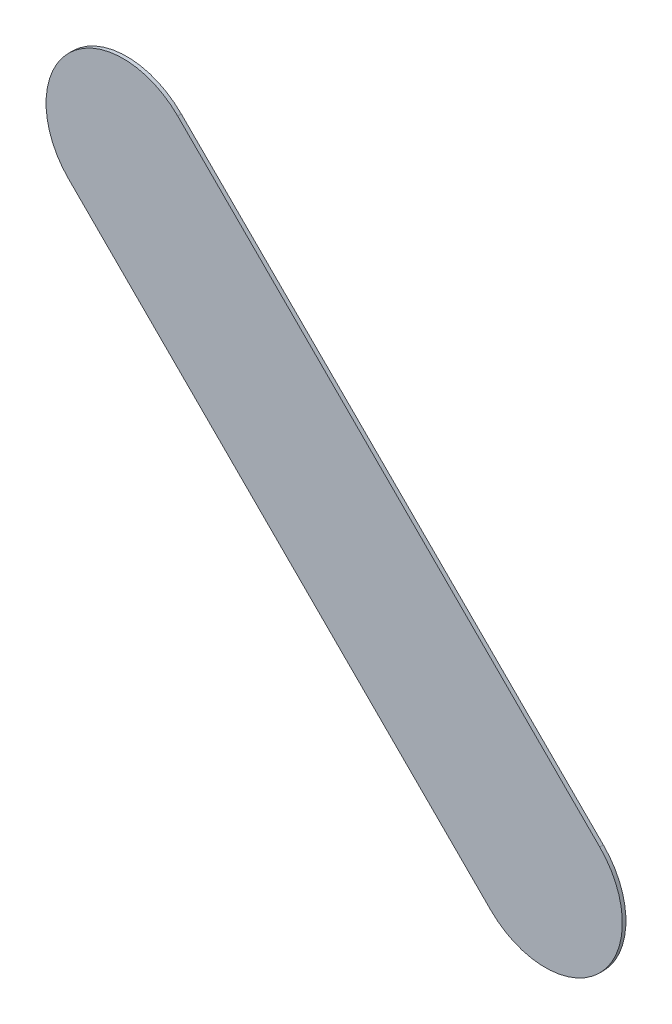
ISO-10303-21;
HEADER;
FILE_DESCRIPTION(('STEP AP214'),'2;1');
FILE_NAME('part.step','',(''),(''),'','','');
FILE_SCHEMA(('AUTOMOTIVE_DESIGN { 1 0 10303 214 1 1 1 1 }'));
ENDSEC;
DATA;
#1=APPLICATION_CONTEXT('core data for automotive mechanical design processes');
#2=APPLICATION_PROTOCOL_DEFINITION('international standard','automotive_design',2000,#1);
#3=PRODUCT_CONTEXT('',#1,'mechanical');
#4=PRODUCT('Part','Part','',(#3));
#5=PRODUCT_RELATED_PRODUCT_CATEGORY('part','',(#4));
#6=PRODUCT_DEFINITION_FORMATION('','',#4);
#7=PRODUCT_DEFINITION_CONTEXT('part definition',#1,'design');
#8=PRODUCT_DEFINITION('design','',#6,#7);
#9=PRODUCT_DEFINITION_SHAPE('','',#8);
#10=(LENGTH_UNIT() NAMED_UNIT(*) SI_UNIT(.MILLI.,.METRE.));
#11=(NAMED_UNIT(*) PLANE_ANGLE_UNIT() SI_UNIT($,.RADIAN.));
#12=(NAMED_UNIT(*) SI_UNIT($,.STERADIAN.) SOLID_ANGLE_UNIT());
#13=UNCERTAINTY_MEASURE_WITH_UNIT(LENGTH_MEASURE(1.E-05),#10,'distance_accuracy_value','');
#14=(GEOMETRIC_REPRESENTATION_CONTEXT(3) GLOBAL_UNCERTAINTY_ASSIGNED_CONTEXT((#13)) GLOBAL_UNIT_ASSIGNED_CONTEXT((#10,
#11,#12)) REPRESENTATION_CONTEXT('',''));
#15=CARTESIAN_POINT('',(0.,0.,0.));
#16=DIRECTION('',(0.,0.,1.));
#17=DIRECTION('',(1.,0.,0.));
#18=AXIS2_PLACEMENT_3D('',#15,#16,#17);
#19=CARTESIAN_POINT('',(120.373669,-141.71433,0.));
#20=DIRECTION('',(0.,0.,1.));
#21=DIRECTION('',(1.,0.,0.));
#22=AXIS2_PLACEMENT_3D('',#19,#20,#21);
#23=PLANE('',#22);
#24=DIRECTION('',(0.707106781186548,-0.707106781186548,0.));
#25=VECTOR('',#24,1.);
#26=CARTESIAN_POINT('',(120.373669,-141.71433,0.));
#27=LINE('',#26,#25);
#28=CARTESIAN_POINT('',(120.373669,-141.71433,0.));
#29=VERTEX_POINT('',#28);
#30=CARTESIAN_POINT('',(124.477669,-145.81833,0.));
#31=VERTEX_POINT('',#30);
#32=EDGE_CURVE('E97',#29,#31,#27,.T.);
#33=ORIENTED_EDGE('',*,*,#32,.T.);
#34=CARTESIAN_POINT('',(125.0079995,-145.2879995,0.));
#35=DIRECTION('',(0.,0.,1.));
#36=DIRECTION('',(-0.707106781186548,-0.707106781186548,0.));
#37=AXIS2_PLACEMENT_3D('',#34,#35,#36);
#38=CIRCLE('',#37,0.75000058564);
#39=CARTESIAN_POINT('',(125.53833,-144.757669,0.));
#40=VERTEX_POINT('',#39);
#41=EDGE_CURVE('E77',#31,#40,#38,.T.);
#42=ORIENTED_EDGE('',*,*,#41,.T.);
#43=DIRECTION('',(-0.707106781186548,0.707106781186548,0.));
#44=VECTOR('',#43,1.);
#45=CARTESIAN_POINT('',(125.53833,-144.757669,0.));
#46=LINE('',#45,#44);
#47=CARTESIAN_POINT('',(121.43433,-140.653669,0.));
#48=VERTEX_POINT('',#47);
#49=EDGE_CURVE('E20',#40,#48,#46,.T.);
#50=ORIENTED_EDGE('',*,*,#49,.T.);
#51=CARTESIAN_POINT('',(120.9039995,-141.1839995,0.));
#52=DIRECTION('',(0.,0.,1.));
#53=DIRECTION('',(0.707106781186548,0.707106781186548,0.));
#54=AXIS2_PLACEMENT_3D('',#51,#52,#53);
#55=CIRCLE('',#54,0.75000058564);
#56=EDGE_CURVE('E11',#48,#29,#55,.T.);
#57=ORIENTED_EDGE('',*,*,#56,.T.);
#58=EDGE_LOOP('',(#33,#42,#50,#57));
#59=FACE_BOUND('',#58,.T.);
#60=ADVANCED_FACE('F17',(#59),#23,.T.);
#61=CARTESIAN_POINT('',(120.373669,-141.71433,-0.035));
#62=DIRECTION('',(0.,0.,1.));
#63=DIRECTION('',(1.,0.,0.));
#64=AXIS2_PLACEMENT_3D('',#61,#62,#63);
#65=PLANE('',#64);
#66=CARTESIAN_POINT('',(120.9039995,-141.1839995,-0.035));
#67=DIRECTION('',(0.,0.,1.));
#68=DIRECTION('',(0.707106781186548,0.707106781186548,0.));
#69=AXIS2_PLACEMENT_3D('',#66,#67,#68);
#70=CIRCLE('',#69,0.75000058564);
#71=CARTESIAN_POINT('',(121.43433,-140.653669,-0.035));
#72=VERTEX_POINT('',#71);
#73=CARTESIAN_POINT('',(120.373669,-141.71433,-0.035));
#74=VERTEX_POINT('',#73);
#75=EDGE_CURVE('E27',#72,#74,#70,.T.);
#76=ORIENTED_EDGE('',*,*,#75,.F.);
#77=DIRECTION('',(-0.707106781186548,0.707106781186548,0.));
#78=VECTOR('',#77,1.);
#79=CARTESIAN_POINT('',(125.53833,-144.757669,-0.035));
#80=LINE('',#79,#78);
#81=CARTESIAN_POINT('',(125.53833,-144.757669,-0.035));
#82=VERTEX_POINT('',#81);
#83=EDGE_CURVE('E65',#82,#72,#80,.T.);
#84=ORIENTED_EDGE('',*,*,#83,.F.);
#85=CARTESIAN_POINT('',(125.0079995,-145.2879995,-0.035));
#86=DIRECTION('',(0.,0.,1.));
#87=DIRECTION('',(-0.707106781186548,-0.707106781186548,0.));
#88=AXIS2_PLACEMENT_3D('',#85,#86,#87);
#89=CIRCLE('',#88,0.75000058564);
#90=CARTESIAN_POINT('',(124.477669,-145.81833,-0.035));
#91=VERTEX_POINT('',#90);
#92=EDGE_CURVE('E70',#91,#82,#89,.T.);
#93=ORIENTED_EDGE('',*,*,#92,.F.);
#94=DIRECTION('',(0.707106781186548,-0.707106781186548,0.));
#95=VECTOR('',#94,1.);
#96=CARTESIAN_POINT('',(120.373669,-141.71433,-0.035));
#97=LINE('',#96,#95);
#98=EDGE_CURVE('E115',#74,#91,#97,.T.);
#99=ORIENTED_EDGE('',*,*,#98,.F.);
#100=EDGE_LOOP('',(#76,#84,#93,#99));
#101=FACE_BOUND('',#100,.T.);
#102=ADVANCED_FACE('F67',(#101),#65,.F.);
#103=CARTESIAN_POINT('',(120.9039995,-141.1839995,-0.035));
#104=DIRECTION('',(0.,0.,-1.));
#105=DIRECTION('',(0.707106781186548,0.707106781186548,0.));
#106=AXIS2_PLACEMENT_3D('',#103,#104,#105);
#107=CYLINDRICAL_SURFACE('',#106,0.75000058564);
#108=ORIENTED_EDGE('',*,*,#75,.T.);
#109=DIRECTION('',(0.,0.,1.));
#110=VECTOR('',#109,1.);
#111=CARTESIAN_POINT('',(120.373669,-141.71433,-0.035));
#112=LINE('',#111,#110);
#113=EDGE_CURVE('E91',#74,#29,#112,.T.);
#114=ORIENTED_EDGE('',*,*,#113,.T.);
#115=ORIENTED_EDGE('',*,*,#56,.F.);
#116=DIRECTION('',(0.,0.,1.));
#117=VECTOR('',#116,1.);
#118=CARTESIAN_POINT('',(121.43433,-140.653669,-0.035));
#119=LINE('',#118,#117);
#120=EDGE_CURVE('E76',#72,#48,#119,.T.);
#121=ORIENTED_EDGE('',*,*,#120,.F.);
#122=EDGE_LOOP('',(#108,#114,#115,#121));
#123=FACE_BOUND('',#122,.T.);
#124=ADVANCED_FACE('F172',(#123),#107,.T.);
#125=CARTESIAN_POINT('',(125.53833,-144.757669,-0.035));
#126=DIRECTION('',(-0.707106781186548,-0.707106781186548,0.));
#127=DIRECTION('',(-0.707106781186548,0.707106781186548,0.));
#128=AXIS2_PLACEMENT_3D('',#125,#126,#127);
#129=PLANE('',#128);
#130=ORIENTED_EDGE('',*,*,#83,.T.);
#131=ORIENTED_EDGE('',*,*,#120,.T.);
#132=ORIENTED_EDGE('',*,*,#49,.F.);
#133=DIRECTION('',(0.,0.,1.));
#134=VECTOR('',#133,1.);
#135=CARTESIAN_POINT('',(125.53833,-144.757669,-0.035));
#136=LINE('',#135,#134);
#137=EDGE_CURVE('E80',#82,#40,#136,.T.);
#138=ORIENTED_EDGE('',*,*,#137,.F.);
#139=EDGE_LOOP('',(#130,#131,#132,#138));
#140=FACE_BOUND('',#139,.T.);
#141=ADVANCED_FACE('F81',(#140),#129,.F.);
#142=CARTESIAN_POINT('',(125.0079995,-145.2879995,-0.035));
#143=DIRECTION('',(0.,0.,-1.));
#144=DIRECTION('',(-0.707106781186548,-0.707106781186548,0.));
#145=AXIS2_PLACEMENT_3D('',#142,#143,#144);
#146=CYLINDRICAL_SURFACE('',#145,0.75000058564);
#147=ORIENTED_EDGE('',*,*,#92,.T.);
#148=ORIENTED_EDGE('',*,*,#137,.T.);
#149=ORIENTED_EDGE('',*,*,#41,.F.);
#150=DIRECTION('',(0.,0.,1.));
#151=VECTOR('',#150,1.);
#152=CARTESIAN_POINT('',(124.477669,-145.81833,-0.035));
#153=LINE('',#152,#151);
#154=EDGE_CURVE('E88',#91,#31,#153,.T.);
#155=ORIENTED_EDGE('',*,*,#154,.F.);
#156=EDGE_LOOP('',(#147,#148,#149,#155));
#157=FACE_BOUND('',#156,.T.);
#158=ADVANCED_FACE('F86',(#157),#146,.T.);
#159=CARTESIAN_POINT('',(120.373669,-141.71433,-0.035));
#160=DIRECTION('',(0.707106781186548,0.707106781186548,0.));
#161=DIRECTION('',(0.,0.,-1.));
#162=AXIS2_PLACEMENT_3D('',#159,#160,#161);
#163=PLANE('',#162);
#164=ORIENTED_EDGE('',*,*,#98,.T.);
#165=ORIENTED_EDGE('',*,*,#154,.T.);
#166=ORIENTED_EDGE('',*,*,#32,.F.);
#167=ORIENTED_EDGE('',*,*,#113,.F.);
#168=EDGE_LOOP('',(#164,#165,#166,#167));
#169=FACE_BOUND('',#168,.T.);
#170=ADVANCED_FACE('F114',(#169),#163,.F.);
#171=CLOSED_SHELL('',(#60,#102,#124,#141,#158,#170));
#172=MANIFOLD_SOLID_BREP('B1',#171);
#173=ADVANCED_BREP_SHAPE_REPRESENTATION('',(#18,#172),#14);
#174=SHAPE_DEFINITION_REPRESENTATION(#9,#173);
ENDSEC;
END-ISO-10303-21;
